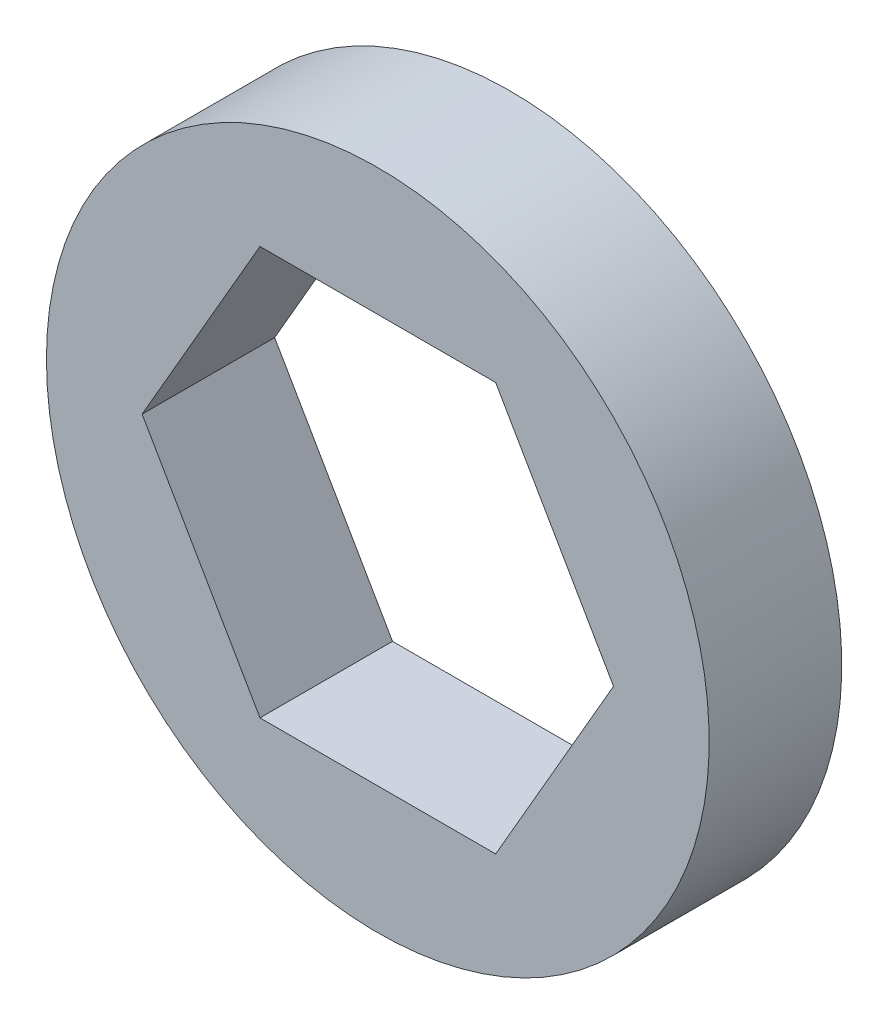
ISO-10303-21;
HEADER;
FILE_DESCRIPTION(('STEP AP214'),'2;1');
FILE_NAME('part.step','',(''),(''),'','','');
FILE_SCHEMA(('AUTOMOTIVE_DESIGN { 1 0 10303 214 1 1 1 1 }'));
ENDSEC;
DATA;
#1=APPLICATION_CONTEXT('core data for automotive mechanical design processes');
#2=APPLICATION_PROTOCOL_DEFINITION('international standard','automotive_design',2000,#1);
#3=PRODUCT_CONTEXT('',#1,'mechanical');
#4=PRODUCT('Part','Part','',(#3));
#5=PRODUCT_RELATED_PRODUCT_CATEGORY('part','',(#4));
#6=PRODUCT_DEFINITION_FORMATION('','',#4);
#7=PRODUCT_DEFINITION_CONTEXT('part definition',#1,'design');
#8=PRODUCT_DEFINITION('design','',#6,#7);
#9=PRODUCT_DEFINITION_SHAPE('','',#8);
#10=(LENGTH_UNIT() NAMED_UNIT(*) SI_UNIT(.MILLI.,.METRE.));
#11=(NAMED_UNIT(*) PLANE_ANGLE_UNIT() SI_UNIT($,.RADIAN.));
#12=(NAMED_UNIT(*) SI_UNIT($,.STERADIAN.) SOLID_ANGLE_UNIT());
#13=UNCERTAINTY_MEASURE_WITH_UNIT(LENGTH_MEASURE(1.E-05),#10,'distance_accuracy_value','');
#14=(GEOMETRIC_REPRESENTATION_CONTEXT(3) GLOBAL_UNCERTAINTY_ASSIGNED_CONTEXT((#13)) GLOBAL_UNIT_ASSIGNED_CONTEXT((#10,
#11,#12)) REPRESENTATION_CONTEXT('',''));
#15=CARTESIAN_POINT('',(0.,0.,0.));
#16=DIRECTION('',(0.,0.,1.));
#17=DIRECTION('',(1.,0.,0.));
#18=AXIS2_PLACEMENT_3D('',#15,#16,#17);
#19=CARTESIAN_POINT('',(0.,0.,-1.5875));
#20=DIRECTION('',(0.,0.,1.));
#21=DIRECTION('',(1.,0.,0.));
#22=AXIS2_PLACEMENT_3D('',#19,#20,#21);
#23=PLANE('',#22);
#24=CARTESIAN_POINT('',(0.,0.,-1.5875));
#25=DIRECTION('',(0.,0.,-1.));
#26=DIRECTION('',(-1.,0.,0.));
#27=AXIS2_PLACEMENT_3D('',#24,#25,#26);
#28=CIRCLE('',#27,7.9375);
#29=CARTESIAN_POINT('',(-7.9375,0.,-1.5875));
#30=VERTEX_POINT('',#29);
#31=EDGE_CURVE('E20',#30,#30,#28,.F.);
#32=ORIENTED_EDGE('',*,*,#31,.F.);
#33=EDGE_LOOP('',(#32));
#34=FACE_BOUND('',#33,.T.);
#35=DIRECTION('',(0.500000000000001,-0.866025403784438,0.));
#36=VECTOR('',#35,1.);
#37=CARTESIAN_POINT('',(5.64590828240535,0.,-1.5875));
#38=LINE('',#37,#36);
#39=CARTESIAN_POINT('',(2.82295414120267,4.8895,-1.5875));
#40=VERTEX_POINT('',#39);
#41=CARTESIAN_POINT('',(5.64590828240535,0.,-1.5875));
#42=VERTEX_POINT('',#41);
#43=EDGE_CURVE('E66',#40,#42,#38,.T.);
#44=ORIENTED_EDGE('',*,*,#43,.F.);
#45=DIRECTION('',(1.,0.,0.));
#46=VECTOR('',#45,1.);
#47=CARTESIAN_POINT('',(2.82295414120267,4.8895,-1.5875));
#48=LINE('',#47,#46);
#49=CARTESIAN_POINT('',(-2.82295414120268,4.8895,-1.5875));
#50=VERTEX_POINT('',#49);
#51=EDGE_CURVE('E71',#50,#40,#48,.T.);
#52=ORIENTED_EDGE('',*,*,#51,.F.);
#53=DIRECTION('',(0.5,0.866025403784439,0.));
#54=VECTOR('',#53,1.);
#55=CARTESIAN_POINT('',(-2.82295414120268,4.8895,-1.5875));
#56=LINE('',#55,#54);
#57=CARTESIAN_POINT('',(-5.64590828240535,0.,-1.5875));
#58=VERTEX_POINT('',#57);
#59=EDGE_CURVE('E105',#58,#50,#56,.T.);
#60=ORIENTED_EDGE('',*,*,#59,.F.);
#61=DIRECTION('',(-0.5,0.866025403784439,0.));
#62=VECTOR('',#61,1.);
#63=CARTESIAN_POINT('',(-5.64590828240535,0.,-1.5875));
#64=LINE('',#63,#62);
#65=CARTESIAN_POINT('',(-2.82295414120268,-4.8895,-1.5875));
#66=VERTEX_POINT('',#65);
#67=EDGE_CURVE('E102',#66,#58,#64,.T.);
#68=ORIENTED_EDGE('',*,*,#67,.F.);
#69=DIRECTION('',(-1.,0.,0.));
#70=VECTOR('',#69,1.);
#71=CARTESIAN_POINT('',(-2.82295414120268,-4.8895,-1.5875));
#72=LINE('',#71,#70);
#73=CARTESIAN_POINT('',(2.82295414120268,-4.8895,-1.5875));
#74=VERTEX_POINT('',#73);
#75=EDGE_CURVE('E97',#74,#66,#72,.T.);
#76=ORIENTED_EDGE('',*,*,#75,.F.);
#77=DIRECTION('',(-0.5,-0.866025403784439,0.));
#78=VECTOR('',#77,1.);
#79=CARTESIAN_POINT('',(2.82295414120268,-4.8895,-1.5875));
#80=LINE('',#79,#78);
#81=EDGE_CURVE('E82',#42,#74,#80,.T.);
#82=ORIENTED_EDGE('',*,*,#81,.F.);
#83=EDGE_LOOP('',(#44,#52,#60,#68,#76,#82));
#84=FACE_BOUND('',#83,.T.);
#85=ADVANCED_FACE('F17',(#34,#84),#23,.F.);
#86=CARTESIAN_POINT('',(2.82295414120267,4.8895,1.5875));
#87=DIRECTION('',(0.,-1.,0.));
#88=DIRECTION('',(1.,0.,0.));
#89=AXIS2_PLACEMENT_3D('',#86,#87,#88);
#90=PLANE('',#89);
#91=ORIENTED_EDGE('',*,*,#51,.T.);
#92=DIRECTION('',(0.,0.,1.));
#93=VECTOR('',#92,1.);
#94=CARTESIAN_POINT('',(2.82295414120267,4.8895,1.5875));
#95=LINE('',#94,#93);
#96=CARTESIAN_POINT('',(2.82295414120267,4.8895,1.5875));
#97=VERTEX_POINT('',#96);
#98=EDGE_CURVE('E73',#97,#40,#95,.F.);
#99=ORIENTED_EDGE('',*,*,#98,.F.);
#100=DIRECTION('',(1.,0.,0.));
#101=VECTOR('',#100,1.);
#102=CARTESIAN_POINT('',(0.,4.8895,1.5875));
#103=LINE('',#102,#101);
#104=CARTESIAN_POINT('',(-2.82295414120268,4.8895,1.5875));
#105=VERTEX_POINT('',#104);
#106=EDGE_CURVE('E108',#105,#97,#103,.T.);
#107=ORIENTED_EDGE('',*,*,#106,.F.);
#108=DIRECTION('',(0.,0.,1.));
#109=VECTOR('',#108,1.);
#110=CARTESIAN_POINT('',(-2.82295414120268,4.8895,1.5875));
#111=LINE('',#110,#109);
#112=EDGE_CURVE('E76',#50,#105,#111,.T.);
#113=ORIENTED_EDGE('',*,*,#112,.F.);
#114=EDGE_LOOP('',(#91,#99,#107,#113));
#115=FACE_BOUND('',#114,.T.);
#116=ADVANCED_FACE('F72',(#115),#90,.T.);
#117=CARTESIAN_POINT('',(5.64590828240535,0.,1.5875));
#118=DIRECTION('',(-0.866025403784438,-0.500000000000001,0.));
#119=DIRECTION('',(0.500000000000001,-0.866025403784438,0.));
#120=AXIS2_PLACEMENT_3D('',#117,#118,#119);
#121=PLANE('',#120);
#122=ORIENTED_EDGE('',*,*,#43,.T.);
#123=DIRECTION('',(0.,0.,1.));
#124=VECTOR('',#123,1.);
#125=CARTESIAN_POINT('',(5.64590828240535,0.,1.5875));
#126=LINE('',#125,#124);
#127=CARTESIAN_POINT('',(5.64590828240535,0.,1.5875));
#128=VERTEX_POINT('',#127);
#129=EDGE_CURVE('E84',#128,#42,#126,.F.);
#130=ORIENTED_EDGE('',*,*,#129,.F.);
#131=DIRECTION('',(0.500000000000001,-0.866025403784438,0.));
#132=VECTOR('',#131,1.);
#133=CARTESIAN_POINT('',(2.82295414120267,4.8895,1.5875));
#134=LINE('',#133,#132);
#135=EDGE_CURVE('E88',#97,#128,#134,.T.);
#136=ORIENTED_EDGE('',*,*,#135,.F.);
#137=ORIENTED_EDGE('',*,*,#98,.T.);
#138=EDGE_LOOP('',(#122,#130,#136,#137));
#139=FACE_BOUND('',#138,.T.);
#140=ADVANCED_FACE('F86',(#139),#121,.T.);
#141=CARTESIAN_POINT('',(2.82295414120268,-4.8895,1.5875));
#142=DIRECTION('',(-0.866025403784439,0.5,0.));
#143=DIRECTION('',(-0.5,-0.866025403784439,0.));
#144=AXIS2_PLACEMENT_3D('',#141,#142,#143);
#145=PLANE('',#144);
#146=ORIENTED_EDGE('',*,*,#81,.T.);
#147=DIRECTION('',(0.,0.,1.));
#148=VECTOR('',#147,1.);
#149=CARTESIAN_POINT('',(2.82295414120268,-4.8895,1.5875));
#150=LINE('',#149,#148);
#151=CARTESIAN_POINT('',(2.82295414120268,-4.8895,1.5875));
#152=VERTEX_POINT('',#151);
#153=EDGE_CURVE('E94',#152,#74,#150,.F.);
#154=ORIENTED_EDGE('',*,*,#153,.F.);
#155=DIRECTION('',(-0.5,-0.866025403784439,0.));
#156=VECTOR('',#155,1.);
#157=CARTESIAN_POINT('',(5.64590828240535,0.,1.5875));
#158=LINE('',#157,#156);
#159=EDGE_CURVE('E111',#128,#152,#158,.T.);
#160=ORIENTED_EDGE('',*,*,#159,.F.);
#161=ORIENTED_EDGE('',*,*,#129,.T.);
#162=EDGE_LOOP('',(#146,#154,#160,#161));
#163=FACE_BOUND('',#162,.T.);
#164=ADVANCED_FACE('F132',(#163),#145,.T.);
#165=CARTESIAN_POINT('',(-2.82295414120268,-4.8895,1.5875));
#166=DIRECTION('',(0.,1.,0.));
#167=DIRECTION('',(-1.,0.,0.));
#168=AXIS2_PLACEMENT_3D('',#165,#166,#167);
#169=PLANE('',#168);
#170=ORIENTED_EDGE('',*,*,#75,.T.);
#171=DIRECTION('',(0.,0.,1.));
#172=VECTOR('',#171,1.);
#173=CARTESIAN_POINT('',(-2.82295414120268,-4.8895,1.5875));
#174=LINE('',#173,#172);
#175=CARTESIAN_POINT('',(-2.82295414120268,-4.8895,1.5875));
#176=VERTEX_POINT('',#175);
#177=EDGE_CURVE('E99',#176,#66,#174,.F.);
#178=ORIENTED_EDGE('',*,*,#177,.F.);
#179=DIRECTION('',(1.,0.,0.));
#180=VECTOR('',#179,1.);
#181=CARTESIAN_POINT('',(0.,-4.8895,1.5875));
#182=LINE('',#181,#180);
#183=EDGE_CURVE('E114',#152,#176,#182,.F.);
#184=ORIENTED_EDGE('',*,*,#183,.F.);
#185=ORIENTED_EDGE('',*,*,#153,.T.);
#186=EDGE_LOOP('',(#170,#178,#184,#185));
#187=FACE_BOUND('',#186,.T.);
#188=ADVANCED_FACE('F129',(#187),#169,.T.);
#189=CARTESIAN_POINT('',(-5.64590828240535,0.,1.5875));
#190=DIRECTION('',(0.866025403784439,0.5,0.));
#191=DIRECTION('',(-0.5,0.866025403784439,0.));
#192=AXIS2_PLACEMENT_3D('',#189,#190,#191);
#193=PLANE('',#192);
#194=ORIENTED_EDGE('',*,*,#67,.T.);
#195=DIRECTION('',(0.,0.,1.));
#196=VECTOR('',#195,1.);
#197=CARTESIAN_POINT('',(-5.64590828240535,0.,1.5875));
#198=LINE('',#197,#196);
#199=CARTESIAN_POINT('',(-5.64590828240535,0.,1.5875));
#200=VERTEX_POINT('',#199);
#201=EDGE_CURVE('E34',#200,#58,#198,.F.);
#202=ORIENTED_EDGE('',*,*,#201,.F.);
#203=DIRECTION('',(-0.5,0.866025403784439,0.));
#204=VECTOR('',#203,1.);
#205=CARTESIAN_POINT('',(-2.82295414120268,-4.8895,1.5875));
#206=LINE('',#205,#204);
#207=EDGE_CURVE('E117',#176,#200,#206,.T.);
#208=ORIENTED_EDGE('',*,*,#207,.F.);
#209=ORIENTED_EDGE('',*,*,#177,.T.);
#210=EDGE_LOOP('',(#194,#202,#208,#209));
#211=FACE_BOUND('',#210,.T.);
#212=ADVANCED_FACE('F126',(#211),#193,.T.);
#213=CARTESIAN_POINT('',(-2.82295414120268,4.8895,1.5875));
#214=DIRECTION('',(0.866025403784439,-0.5,0.));
#215=DIRECTION('',(0.5,0.866025403784439,0.));
#216=AXIS2_PLACEMENT_3D('',#213,#214,#215);
#217=PLANE('',#216);
#218=ORIENTED_EDGE('',*,*,#59,.T.);
#219=ORIENTED_EDGE('',*,*,#112,.T.);
#220=DIRECTION('',(0.5,0.866025403784439,0.));
#221=VECTOR('',#220,1.);
#222=CARTESIAN_POINT('',(-5.64590828240535,0.,1.5875));
#223=LINE('',#222,#221);
#224=EDGE_CURVE('E26',#200,#105,#223,.T.);
#225=ORIENTED_EDGE('',*,*,#224,.F.);
#226=ORIENTED_EDGE('',*,*,#201,.T.);
#227=EDGE_LOOP('',(#218,#219,#225,#226));
#228=FACE_BOUND('',#227,.T.);
#229=ADVANCED_FACE('F124',(#228),#217,.T.);
#230=CARTESIAN_POINT('',(0.,0.,1.5875));
#231=DIRECTION('',(0.,0.,-1.));
#232=DIRECTION('',(-1.,0.,0.));
#233=AXIS2_PLACEMENT_3D('',#230,#231,#232);
#234=CYLINDRICAL_SURFACE('',#233,7.9375);
#235=ORIENTED_EDGE('',*,*,#31,.T.);
#236=EDGE_LOOP('',(#235));
#237=FACE_BOUND('',#236,.T.);
#238=CARTESIAN_POINT('',(0.,0.,1.5875));
#239=DIRECTION('',(0.,0.,-1.));
#240=DIRECTION('',(-1.,0.,0.));
#241=AXIS2_PLACEMENT_3D('',#238,#239,#240);
#242=CIRCLE('',#241,7.9375);
#243=CARTESIAN_POINT('',(-7.9375,0.,1.5875));
#244=VERTEX_POINT('',#243);
#245=EDGE_CURVE('E11',#244,#244,#242,.F.);
#246=ORIENTED_EDGE('',*,*,#245,.F.);
#247=EDGE_LOOP('',(#246));
#248=FACE_BOUND('',#247,.T.);
#249=ADVANCED_FACE('F143',(#237,#248),#234,.T.);
#250=CARTESIAN_POINT('',(0.,0.,1.5875));
#251=DIRECTION('',(0.,0.,1.));
#252=DIRECTION('',(1.,0.,0.));
#253=AXIS2_PLACEMENT_3D('',#250,#251,#252);
#254=PLANE('',#253);
#255=ORIENTED_EDGE('',*,*,#245,.T.);
#256=EDGE_LOOP('',(#255));
#257=FACE_BOUND('',#256,.T.);
#258=ORIENTED_EDGE('',*,*,#207,.T.);
#259=ORIENTED_EDGE('',*,*,#224,.T.);
#260=ORIENTED_EDGE('',*,*,#106,.T.);
#261=ORIENTED_EDGE('',*,*,#135,.T.);
#262=ORIENTED_EDGE('',*,*,#159,.T.);
#263=ORIENTED_EDGE('',*,*,#183,.T.);
#264=EDGE_LOOP('',(#258,#259,#260,#261,#262,#263));
#265=FACE_BOUND('',#264,.T.);
#266=ADVANCED_FACE('F122',(#257,#265),#254,.T.);
#267=CLOSED_SHELL('',(#85,#116,#140,#164,#188,#212,#229,#249,#266));
#268=MANIFOLD_SOLID_BREP('B1',#267);
#269=ADVANCED_BREP_SHAPE_REPRESENTATION('',(#18,#268),#14);
#270=SHAPE_DEFINITION_REPRESENTATION(#9,#269);
ENDSEC;
END-ISO-10303-21;
